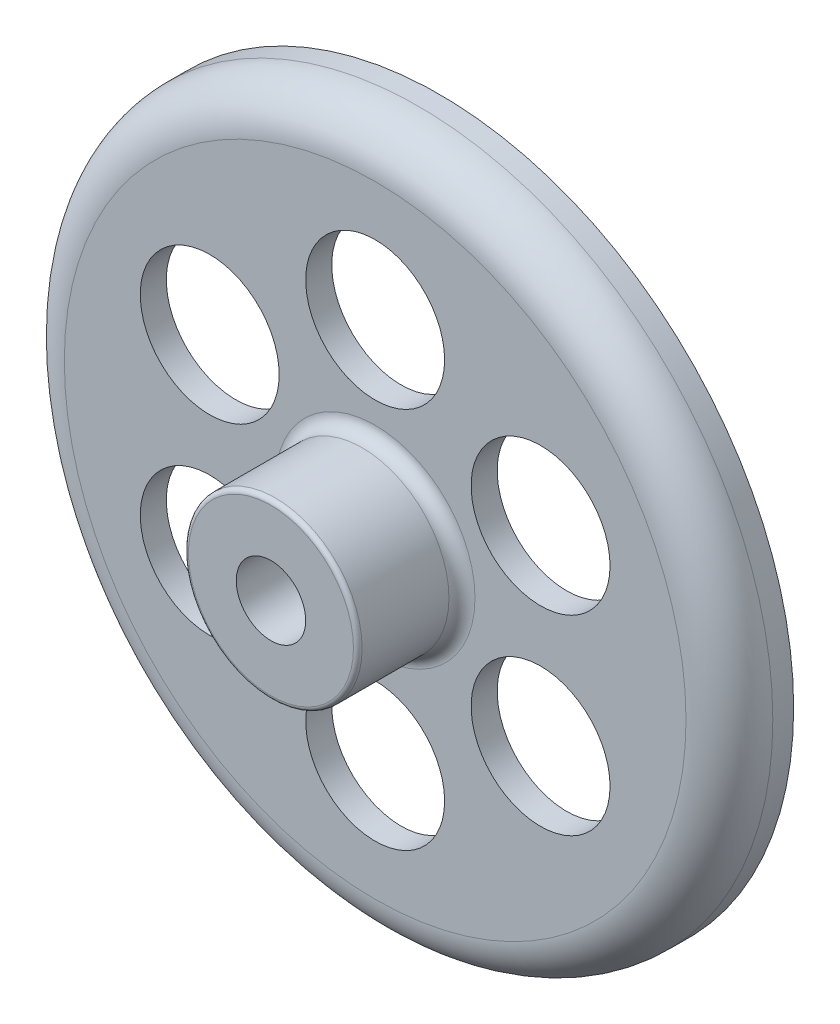
ISO-10303-21;
HEADER;
FILE_DESCRIPTION(('STEP AP214'),'2;1');
FILE_NAME('part.step','',(''),(''),'','','');
FILE_SCHEMA(('AUTOMOTIVE_DESIGN { 1 0 10303 214 1 1 1 1 }'));
ENDSEC;
DATA;
#1=APPLICATION_CONTEXT('core data for automotive mechanical design processes');
#2=APPLICATION_PROTOCOL_DEFINITION('international standard','automotive_design',2000,#1);
#3=PRODUCT_CONTEXT('',#1,'mechanical');
#4=PRODUCT('Part','Part','',(#3));
#5=PRODUCT_RELATED_PRODUCT_CATEGORY('part','',(#4));
#6=PRODUCT_DEFINITION_FORMATION('','',#4);
#7=PRODUCT_DEFINITION_CONTEXT('part definition',#1,'design');
#8=PRODUCT_DEFINITION('design','',#6,#7);
#9=PRODUCT_DEFINITION_SHAPE('','',#8);
#10=(LENGTH_UNIT() NAMED_UNIT(*) SI_UNIT(.MILLI.,.METRE.));
#11=(NAMED_UNIT(*) PLANE_ANGLE_UNIT() SI_UNIT($,.RADIAN.));
#12=(NAMED_UNIT(*) SI_UNIT($,.STERADIAN.) SOLID_ANGLE_UNIT());
#13=UNCERTAINTY_MEASURE_WITH_UNIT(LENGTH_MEASURE(1.E-05),#10,'distance_accuracy_value','');
#14=(GEOMETRIC_REPRESENTATION_CONTEXT(3) GLOBAL_UNCERTAINTY_ASSIGNED_CONTEXT((#13)) GLOBAL_UNIT_ASSIGNED_CONTEXT((#10,
#11,#12)) REPRESENTATION_CONTEXT('',''));
#15=CARTESIAN_POINT('',(0.,0.,0.));
#16=DIRECTION('',(0.,0.,1.));
#17=DIRECTION('',(1.,0.,0.));
#18=AXIS2_PLACEMENT_3D('',#15,#16,#17);
#19=CARTESIAN_POINT('',(0.,0.,0.600000000000001));
#20=DIRECTION('',(0.,0.,1.));
#21=DIRECTION('',(1.,0.,0.));
#22=AXIS2_PLACEMENT_3D('',#19,#20,#21);
#23=CYLINDRICAL_SURFACE('',#22,20.4);
#24=CARTESIAN_POINT('',(0.,0.,0.));
#25=DIRECTION('',(0.,0.,1.));
#26=DIRECTION('',(1.,0.,0.));
#27=AXIS2_PLACEMENT_3D('',#24,#25,#26);
#28=CIRCLE('',#27,20.4);
#29=CARTESIAN_POINT('',(20.4,0.,0.));
#30=VERTEX_POINT('',#29);
#31=EDGE_CURVE('E18',#30,#30,#28,.F.);
#32=ORIENTED_EDGE('',*,*,#31,.F.);
#33=EDGE_LOOP('',(#32));
#34=FACE_BOUND('',#33,.T.);
#35=CARTESIAN_POINT('',(0.,0.,1.20000000000001));
#36=DIRECTION('',(0.,0.,1.));
#37=DIRECTION('',(1.,0.,0.));
#38=AXIS2_PLACEMENT_3D('',#35,#36,#37);
#39=CIRCLE('',#38,20.4);
#40=CARTESIAN_POINT('',(20.4,0.,1.20000000000001));
#41=VERTEX_POINT('',#40);
#42=EDGE_CURVE('E85',#41,#41,#39,.T.);
#43=ORIENTED_EDGE('',*,*,#42,.F.);
#44=EDGE_LOOP('',(#43));
#45=FACE_BOUND('',#44,.T.);
#46=ADVANCED_FACE('F15',(#34,#45),#23,.T.);
#47=CARTESIAN_POINT('',(0.,0.,6.95));
#48=DIRECTION('',(0.,0.,1.));
#49=DIRECTION('',(1.,0.,0.));
#50=AXIS2_PLACEMENT_3D('',#47,#48,#49);
#51=CYLINDRICAL_SURFACE('',#50,5.);
#52=CARTESIAN_POINT('',(0.,0.,4.45));
#53=DIRECTION('',(0.,0.,1.));
#54=DIRECTION('',(1.,0.,0.));
#55=AXIS2_PLACEMENT_3D('',#52,#53,#54);
#56=CIRCLE('',#55,5.);
#57=CARTESIAN_POINT('',(5.,0.,4.45));
#58=VERTEX_POINT('',#57);
#59=EDGE_CURVE('E80',#58,#58,#56,.T.);
#60=ORIENTED_EDGE('',*,*,#59,.T.);
#61=EDGE_LOOP('',(#60));
#62=FACE_BOUND('',#61,.T.);
#63=CARTESIAN_POINT('',(0.,0.,9.45));
#64=DIRECTION('',(0.,0.,1.));
#65=DIRECTION('',(1.,0.,0.));
#66=AXIS2_PLACEMENT_3D('',#63,#64,#65);
#67=CIRCLE('',#66,5.);
#68=CARTESIAN_POINT('',(5.,0.,9.45));
#69=VERTEX_POINT('',#68);
#70=EDGE_CURVE('E74',#69,#69,#67,.T.);
#71=ORIENTED_EDGE('',*,*,#70,.F.);
#72=EDGE_LOOP('',(#71));
#73=FACE_BOUND('',#72,.T.);
#74=ADVANCED_FACE('F209',(#62,#73),#51,.T.);
#75=CARTESIAN_POINT('',(19.65,0.,0.));
#76=DIRECTION('',(0.,0.,-1.));
#77=DIRECTION('',(-1.,0.,0.));
#78=AXIS2_PLACEMENT_3D('',#75,#76,#77);
#79=PLANE('',#78);
#80=CARTESIAN_POINT('',(0.,0.,0.));
#81=DIRECTION('',(0.,0.,1.));
#82=DIRECTION('',(1.,0.,0.));
#83=AXIS2_PLACEMENT_3D('',#80,#81,#82);
#84=CIRCLE('',#83,18.9);
#85=CARTESIAN_POINT('',(18.9,0.,0.));
#86=VERTEX_POINT('',#85);
#87=EDGE_CURVE('E71',#86,#86,#84,.T.);
#88=ORIENTED_EDGE('',*,*,#87,.T.);
#89=EDGE_LOOP('',(#88));
#90=FACE_BOUND('',#89,.T.);
#91=ORIENTED_EDGE('',*,*,#31,.T.);
#92=EDGE_LOOP('',(#91));
#93=FACE_BOUND('',#92,.T.);
#94=ADVANCED_FACE('F212',(#90,#93),#79,.T.);
#95=CARTESIAN_POINT('',(0.,0.,1.20000000000001));
#96=DIRECTION('',(0.,0.,1.));
#97=DIRECTION('',(1.,0.,0.));
#98=AXIS2_PLACEMENT_3D('',#95,#96,#97);
#99=TOROIDAL_SURFACE('',#98,17.9,2.5);
#100=ORIENTED_EDGE('',*,*,#42,.T.);
#101=EDGE_LOOP('',(#100));
#102=FACE_BOUND('',#101,.T.);
#103=CARTESIAN_POINT('',(0.,0.,3.7));
#104=DIRECTION('',(0.,0.,-1.));
#105=DIRECTION('',(1.,0.,0.));
#106=AXIS2_PLACEMENT_3D('',#103,#104,#105);
#107=CIRCLE('',#106,17.9);
#108=CARTESIAN_POINT('',(17.9,0.,3.7));
#109=VERTEX_POINT('',#108);
#110=EDGE_CURVE('E73',#109,#109,#107,.F.);
#111=ORIENTED_EDGE('',*,*,#110,.F.);
#112=EDGE_LOOP('',(#111));
#113=FACE_BOUND('',#112,.T.);
#114=ADVANCED_FACE('F118',(#102,#113),#99,.T.);
#115=CARTESIAN_POINT('',(0.,0.,4.45000000000001));
#116=DIRECTION('',(0.,0.,1.));
#117=DIRECTION('',(1.,0.,0.));
#118=AXIS2_PLACEMENT_3D('',#115,#116,#117);
#119=TOROIDAL_SURFACE('',#118,5.75000000000001,0.750000000000006);
#120=CARTESIAN_POINT('',(0.,0.,3.7));
#121=DIRECTION('',(0.,0.,1.));
#122=DIRECTION('',(1.,0.,0.));
#123=AXIS2_PLACEMENT_3D('',#120,#121,#122);
#124=CIRCLE('',#123,5.75);
#125=CARTESIAN_POINT('',(5.75,0.,3.7));
#126=VERTEX_POINT('',#125);
#127=EDGE_CURVE('E78',#126,#126,#124,.F.);
#128=ORIENTED_EDGE('',*,*,#127,.F.);
#129=EDGE_LOOP('',(#128));
#130=FACE_BOUND('',#129,.T.);
#131=ORIENTED_EDGE('',*,*,#59,.F.);
#132=EDGE_LOOP('',(#131));
#133=FACE_BOUND('',#132,.T.);
#134=ADVANCED_FACE('F114',(#130,#133),#119,.F.);
#135=CARTESIAN_POINT('',(0.,0.,9.45));
#136=DIRECTION('',(0.,0.,1.));
#137=DIRECTION('',(1.,0.,0.));
#138=AXIS2_PLACEMENT_3D('',#135,#136,#137);
#139=TOROIDAL_SURFACE('',#138,4.75,0.25);
#140=ORIENTED_EDGE('',*,*,#70,.T.);
#141=EDGE_LOOP('',(#140));
#142=FACE_BOUND('',#141,.T.);
#143=CARTESIAN_POINT('',(0.,0.,9.7));
#144=DIRECTION('',(0.,0.,-1.));
#145=DIRECTION('',(1.,0.,0.));
#146=AXIS2_PLACEMENT_3D('',#143,#144,#145);
#147=CIRCLE('',#146,4.75);
#148=CARTESIAN_POINT('',(4.75,0.,9.7));
#149=VERTEX_POINT('',#148);
#150=EDGE_CURVE('E97',#149,#149,#147,.F.);
#151=ORIENTED_EDGE('',*,*,#150,.F.);
#152=EDGE_LOOP('',(#151));
#153=FACE_BOUND('',#152,.T.);
#154=ADVANCED_FACE('F103',(#142,#153),#139,.T.);
#155=CARTESIAN_POINT('',(0.,0.,0.474999999999999));
#156=DIRECTION('',(0.,0.,1.));
#157=DIRECTION('',(1.,0.,0.));
#158=AXIS2_PLACEMENT_3D('',#155,#156,#157);
#159=CYLINDRICAL_SURFACE('',#158,18.9);
#160=CARTESIAN_POINT('',(0.,0.,0.949999999999998));
#161=DIRECTION('',(0.,0.,1.));
#162=DIRECTION('',(1.,0.,0.));
#163=AXIS2_PLACEMENT_3D('',#160,#161,#162);
#164=CIRCLE('',#163,18.9);
#165=CARTESIAN_POINT('',(18.9,0.,0.949999999999998));
#166=VERTEX_POINT('',#165);
#167=EDGE_CURVE('E70',#166,#166,#164,.T.);
#168=ORIENTED_EDGE('',*,*,#167,.T.);
#169=EDGE_LOOP('',(#168));
#170=FACE_BOUND('',#169,.T.);
#171=ORIENTED_EDGE('',*,*,#87,.F.);
#172=EDGE_LOOP('',(#171));
#173=FACE_BOUND('',#172,.T.);
#174=ADVANCED_FACE('F113',(#170,#173),#159,.F.);
#175=CARTESIAN_POINT('',(11.825,0.,3.7));
#176=DIRECTION('',(0.,0.,1.));
#177=DIRECTION('',(1.,0.,0.));
#178=AXIS2_PLACEMENT_3D('',#175,#176,#177);
#179=PLANE('',#178);
#180=ORIENTED_EDGE('',*,*,#127,.T.);
#181=EDGE_LOOP('',(#180));
#182=FACE_BOUND('',#181,.T.);
#183=CARTESIAN_POINT('',(0.,11.,3.7));
#184=DIRECTION('',(0.,0.,1.));
#185=DIRECTION('',(1.,0.,0.));
#186=AXIS2_PLACEMENT_3D('',#183,#184,#185);
#187=CIRCLE('',#186,4.);
#188=CARTESIAN_POINT('',(4.,11.,3.7));
#189=VERTEX_POINT('',#188);
#190=EDGE_CURVE('E53',#189,#189,#187,.F.);
#191=ORIENTED_EDGE('',*,*,#190,.T.);
#192=EDGE_LOOP('',(#191));
#193=FACE_BOUND('',#192,.T.);
#194=CARTESIAN_POINT('',(-9.52627944162882,5.5,3.7));
#195=DIRECTION('',(0.,0.,1.));
#196=DIRECTION('',(1.,0.,0.));
#197=AXIS2_PLACEMENT_3D('',#194,#195,#196);
#198=CIRCLE('',#197,4.);
#199=CARTESIAN_POINT('',(-5.52627944162882,5.5,3.7));
#200=VERTEX_POINT('',#199);
#201=EDGE_CURVE('E56',#200,#200,#198,.F.);
#202=ORIENTED_EDGE('',*,*,#201,.T.);
#203=EDGE_LOOP('',(#202));
#204=FACE_BOUND('',#203,.T.);
#205=CARTESIAN_POINT('',(-9.52627944162883,-5.5,3.7));
#206=DIRECTION('',(0.,0.,1.));
#207=DIRECTION('',(1.,0.,0.));
#208=AXIS2_PLACEMENT_3D('',#205,#206,#207);
#209=CIRCLE('',#208,4.);
#210=CARTESIAN_POINT('',(-5.52627944162883,-5.5,3.7));
#211=VERTEX_POINT('',#210);
#212=EDGE_CURVE('E59',#211,#211,#209,.F.);
#213=ORIENTED_EDGE('',*,*,#212,.T.);
#214=EDGE_LOOP('',(#213));
#215=FACE_BOUND('',#214,.T.);
#216=CARTESIAN_POINT('',(0.,-11.,3.7));
#217=DIRECTION('',(0.,0.,1.));
#218=DIRECTION('',(1.,0.,0.));
#219=AXIS2_PLACEMENT_3D('',#216,#217,#218);
#220=CIRCLE('',#219,4.);
#221=CARTESIAN_POINT('',(4.,-11.,3.7));
#222=VERTEX_POINT('',#221);
#223=EDGE_CURVE('E62',#222,#222,#220,.F.);
#224=ORIENTED_EDGE('',*,*,#223,.T.);
#225=EDGE_LOOP('',(#224));
#226=FACE_BOUND('',#225,.T.);
#227=CARTESIAN_POINT('',(9.52627944162882,-5.50000000000001,3.7));
#228=DIRECTION('',(0.,0.,1.));
#229=DIRECTION('',(1.,0.,0.));
#230=AXIS2_PLACEMENT_3D('',#227,#228,#229);
#231=CIRCLE('',#230,4.);
#232=CARTESIAN_POINT('',(13.5262794416288,-5.50000000000001,3.7));
#233=VERTEX_POINT('',#232);
#234=EDGE_CURVE('E65',#233,#233,#231,.F.);
#235=ORIENTED_EDGE('',*,*,#234,.T.);
#236=EDGE_LOOP('',(#235));
#237=FACE_BOUND('',#236,.T.);
#238=CARTESIAN_POINT('',(9.52627944162883,5.49999999999999,3.7));
#239=DIRECTION('',(0.,0.,1.));
#240=DIRECTION('',(1.,0.,0.));
#241=AXIS2_PLACEMENT_3D('',#238,#239,#240);
#242=CIRCLE('',#241,4.);
#243=CARTESIAN_POINT('',(13.5262794416288,5.49999999999999,3.7));
#244=VERTEX_POINT('',#243);
#245=EDGE_CURVE('E68',#244,#244,#242,.F.);
#246=ORIENTED_EDGE('',*,*,#245,.T.);
#247=EDGE_LOOP('',(#246));
#248=FACE_BOUND('',#247,.T.);
#249=ORIENTED_EDGE('',*,*,#110,.T.);
#250=EDGE_LOOP('',(#249));
#251=FACE_BOUND('',#250,.T.);
#252=ADVANCED_FACE('F143',(#182,#193,#204,#215,#226,#237,#248,#251),#179,.T.);
#253=CARTESIAN_POINT('',(3.375,0.,9.7));
#254=DIRECTION('',(0.,0.,1.));
#255=DIRECTION('',(1.,0.,0.));
#256=AXIS2_PLACEMENT_3D('',#253,#254,#255);
#257=PLANE('',#256);
#258=CARTESIAN_POINT('',(0.,0.,9.7));
#259=DIRECTION('',(0.,0.,1.));
#260=DIRECTION('',(1.,0.,0.));
#261=AXIS2_PLACEMENT_3D('',#258,#259,#260);
#262=CIRCLE('',#261,2.);
#263=CARTESIAN_POINT('',(2.,0.,9.7));
#264=VERTEX_POINT('',#263);
#265=EDGE_CURVE('E50',#264,#264,#262,.F.);
#266=ORIENTED_EDGE('',*,*,#265,.T.);
#267=EDGE_LOOP('',(#266));
#268=FACE_BOUND('',#267,.T.);
#269=ORIENTED_EDGE('',*,*,#150,.T.);
#270=EDGE_LOOP('',(#269));
#271=FACE_BOUND('',#270,.T.);
#272=ADVANCED_FACE('F161',(#268,#271),#257,.T.);
#273=CARTESIAN_POINT('',(0.,0.,0.949999999999998));
#274=DIRECTION('',(0.,0.,1.));
#275=DIRECTION('',(1.,0.,0.));
#276=AXIS2_PLACEMENT_3D('',#273,#274,#275);
#277=TOROIDAL_SURFACE('',#276,17.65,1.25);
#278=CARTESIAN_POINT('',(0.,0.,2.2));
#279=DIRECTION('',(0.,0.,1.));
#280=DIRECTION('',(1.,0.,0.));
#281=AXIS2_PLACEMENT_3D('',#278,#279,#280);
#282=CIRCLE('',#281,17.65);
#283=CARTESIAN_POINT('',(17.65,0.,2.2));
#284=VERTEX_POINT('',#283);
#285=EDGE_CURVE('E49',#284,#284,#282,.F.);
#286=ORIENTED_EDGE('',*,*,#285,.F.);
#287=EDGE_LOOP('',(#286));
#288=FACE_BOUND('',#287,.T.);
#289=ORIENTED_EDGE('',*,*,#167,.F.);
#290=EDGE_LOOP('',(#289));
#291=FACE_BOUND('',#290,.T.);
#292=ADVANCED_FACE('F174',(#288,#291),#277,.F.);
#293=CARTESIAN_POINT('',(9.52627944162883,5.49999999999999,-54.8095718664904));
#294=DIRECTION('',(0.,0.,1.));
#295=DIRECTION('',(1.,0.,0.));
#296=AXIS2_PLACEMENT_3D('',#293,#294,#295);
#297=CYLINDRICAL_SURFACE('',#296,4.);
#298=ORIENTED_EDGE('',*,*,#245,.F.);
#299=EDGE_LOOP('',(#298));
#300=FACE_BOUND('',#299,.T.);
#301=CARTESIAN_POINT('',(9.52627944162883,5.49999999999999,2.20000000000001));
#302=DIRECTION('',(0.,0.,1.));
#303=DIRECTION('',(1.,0.,0.));
#304=AXIS2_PLACEMENT_3D('',#301,#302,#303);
#305=CIRCLE('',#304,4.);
#306=CARTESIAN_POINT('',(13.5262794416288,5.49999999999999,2.20000000000001));
#307=VERTEX_POINT('',#306);
#308=EDGE_CURVE('E46',#307,#307,#305,.T.);
#309=ORIENTED_EDGE('',*,*,#308,.F.);
#310=EDGE_LOOP('',(#309));
#311=FACE_BOUND('',#310,.T.);
#312=ADVANCED_FACE('F180',(#300,#311),#297,.F.);
#313=CARTESIAN_POINT('',(9.52627944162882,-5.50000000000001,-54.8095718664904));
#314=DIRECTION('',(0.,0.,1.));
#315=DIRECTION('',(1.,0.,0.));
#316=AXIS2_PLACEMENT_3D('',#313,#314,#315);
#317=CYLINDRICAL_SURFACE('',#316,4.);
#318=ORIENTED_EDGE('',*,*,#234,.F.);
#319=EDGE_LOOP('',(#318));
#320=FACE_BOUND('',#319,.T.);
#321=CARTESIAN_POINT('',(9.52627944162882,-5.50000000000001,2.20000000000001));
#322=DIRECTION('',(0.,0.,1.));
#323=DIRECTION('',(1.,0.,0.));
#324=AXIS2_PLACEMENT_3D('',#321,#322,#323);
#325=CIRCLE('',#324,4.);
#326=CARTESIAN_POINT('',(13.5262794416288,-5.50000000000001,2.20000000000001));
#327=VERTEX_POINT('',#326);
#328=EDGE_CURVE('E43',#327,#327,#325,.T.);
#329=ORIENTED_EDGE('',*,*,#328,.F.);
#330=EDGE_LOOP('',(#329));
#331=FACE_BOUND('',#330,.T.);
#332=ADVANCED_FACE('F244',(#320,#331),#317,.F.);
#333=CARTESIAN_POINT('',(0.,-11.,-54.8095718664904));
#334=DIRECTION('',(0.,0.,1.));
#335=DIRECTION('',(1.,0.,0.));
#336=AXIS2_PLACEMENT_3D('',#333,#334,#335);
#337=CYLINDRICAL_SURFACE('',#336,4.);
#338=ORIENTED_EDGE('',*,*,#223,.F.);
#339=EDGE_LOOP('',(#338));
#340=FACE_BOUND('',#339,.T.);
#341=CARTESIAN_POINT('',(0.,-11.,2.20000000000001));
#342=DIRECTION('',(0.,0.,1.));
#343=DIRECTION('',(1.,0.,0.));
#344=AXIS2_PLACEMENT_3D('',#341,#342,#343);
#345=CIRCLE('',#344,4.);
#346=CARTESIAN_POINT('',(4.,-11.,2.20000000000001));
#347=VERTEX_POINT('',#346);
#348=EDGE_CURVE('E40',#347,#347,#345,.T.);
#349=ORIENTED_EDGE('',*,*,#348,.F.);
#350=EDGE_LOOP('',(#349));
#351=FACE_BOUND('',#350,.T.);
#352=ADVANCED_FACE('F241',(#340,#351),#337,.F.);
#353=CARTESIAN_POINT('',(-9.52627944162883,-5.5,-54.8095718664904));
#354=DIRECTION('',(0.,0.,1.));
#355=DIRECTION('',(1.,0.,0.));
#356=AXIS2_PLACEMENT_3D('',#353,#354,#355);
#357=CYLINDRICAL_SURFACE('',#356,4.);
#358=ORIENTED_EDGE('',*,*,#212,.F.);
#359=EDGE_LOOP('',(#358));
#360=FACE_BOUND('',#359,.T.);
#361=CARTESIAN_POINT('',(-9.52627944162883,-5.5,2.20000000000001));
#362=DIRECTION('',(0.,0.,1.));
#363=DIRECTION('',(1.,0.,0.));
#364=AXIS2_PLACEMENT_3D('',#361,#362,#363);
#365=CIRCLE('',#364,4.);
#366=CARTESIAN_POINT('',(-5.52627944162883,-5.5,2.20000000000001));
#367=VERTEX_POINT('',#366);
#368=EDGE_CURVE('E37',#367,#367,#365,.T.);
#369=ORIENTED_EDGE('',*,*,#368,.F.);
#370=EDGE_LOOP('',(#369));
#371=FACE_BOUND('',#370,.T.);
#372=ADVANCED_FACE('F237',(#360,#371),#357,.F.);
#373=CARTESIAN_POINT('',(-9.52627944162882,5.5,-54.8095718664904));
#374=DIRECTION('',(0.,0.,1.));
#375=DIRECTION('',(1.,0.,0.));
#376=AXIS2_PLACEMENT_3D('',#373,#374,#375);
#377=CYLINDRICAL_SURFACE('',#376,4.);
#378=ORIENTED_EDGE('',*,*,#201,.F.);
#379=EDGE_LOOP('',(#378));
#380=FACE_BOUND('',#379,.T.);
#381=CARTESIAN_POINT('',(-9.52627944162882,5.5,2.20000000000001));
#382=DIRECTION('',(0.,0.,1.));
#383=DIRECTION('',(1.,0.,0.));
#384=AXIS2_PLACEMENT_3D('',#381,#382,#383);
#385=CIRCLE('',#384,4.);
#386=CARTESIAN_POINT('',(-5.52627944162882,5.5,2.20000000000001));
#387=VERTEX_POINT('',#386);
#388=EDGE_CURVE('E27',#387,#387,#385,.T.);
#389=ORIENTED_EDGE('',*,*,#388,.F.);
#390=EDGE_LOOP('',(#389));
#391=FACE_BOUND('',#390,.T.);
#392=ADVANCED_FACE('F233',(#380,#391),#377,.F.);
#393=CARTESIAN_POINT('',(0.,11.,-54.8095718664904));
#394=DIRECTION('',(0.,0.,1.));
#395=DIRECTION('',(1.,0.,0.));
#396=AXIS2_PLACEMENT_3D('',#393,#394,#395);
#397=CYLINDRICAL_SURFACE('',#396,4.);
#398=ORIENTED_EDGE('',*,*,#190,.F.);
#399=EDGE_LOOP('',(#398));
#400=FACE_BOUND('',#399,.T.);
#401=CARTESIAN_POINT('',(0.,11.,2.20000000000001));
#402=DIRECTION('',(0.,0.,1.));
#403=DIRECTION('',(1.,0.,0.));
#404=AXIS2_PLACEMENT_3D('',#401,#402,#403);
#405=CIRCLE('',#404,4.);
#406=CARTESIAN_POINT('',(4.,11.,2.20000000000001));
#407=VERTEX_POINT('',#406);
#408=EDGE_CURVE('E22',#407,#407,#405,.T.);
#409=ORIENTED_EDGE('',*,*,#408,.F.);
#410=EDGE_LOOP('',(#409));
#411=FACE_BOUND('',#410,.T.);
#412=ADVANCED_FACE('F225',(#400,#411),#397,.F.);
#413=CARTESIAN_POINT('',(0.,0.,5.95));
#414=DIRECTION('',(0.,0.,1.));
#415=DIRECTION('',(1.,0.,0.));
#416=AXIS2_PLACEMENT_3D('',#413,#414,#415);
#417=CYLINDRICAL_SURFACE('',#416,2.);
#418=ORIENTED_EDGE('',*,*,#265,.F.);
#419=EDGE_LOOP('',(#418));
#420=FACE_BOUND('',#419,.T.);
#421=CARTESIAN_POINT('',(0.,0.,2.2));
#422=DIRECTION('',(0.,0.,1.));
#423=DIRECTION('',(1.,0.,0.));
#424=AXIS2_PLACEMENT_3D('',#421,#422,#423);
#425=CIRCLE('',#424,2.);
#426=CARTESIAN_POINT('',(2.,0.,2.2));
#427=VERTEX_POINT('',#426);
#428=EDGE_CURVE('E10',#427,#427,#425,.T.);
#429=ORIENTED_EDGE('',*,*,#428,.F.);
#430=EDGE_LOOP('',(#429));
#431=FACE_BOUND('',#430,.T.);
#432=ADVANCED_FACE('F221',(#420,#431),#417,.F.);
#433=CARTESIAN_POINT('',(9.825,0.,2.2));
#434=DIRECTION('',(0.,0.,-1.));
#435=DIRECTION('',(-1.,0.,0.));
#436=AXIS2_PLACEMENT_3D('',#433,#434,#435);
#437=PLANE('',#436);
#438=ORIENTED_EDGE('',*,*,#428,.T.);
#439=EDGE_LOOP('',(#438));
#440=FACE_BOUND('',#439,.T.);
#441=ORIENTED_EDGE('',*,*,#408,.T.);
#442=EDGE_LOOP('',(#441));
#443=FACE_BOUND('',#442,.T.);
#444=ORIENTED_EDGE('',*,*,#388,.T.);
#445=EDGE_LOOP('',(#444));
#446=FACE_BOUND('',#445,.T.);
#447=ORIENTED_EDGE('',*,*,#368,.T.);
#448=EDGE_LOOP('',(#447));
#449=FACE_BOUND('',#448,.T.);
#450=ORIENTED_EDGE('',*,*,#348,.T.);
#451=EDGE_LOOP('',(#450));
#452=FACE_BOUND('',#451,.T.);
#453=ORIENTED_EDGE('',*,*,#328,.T.);
#454=EDGE_LOOP('',(#453));
#455=FACE_BOUND('',#454,.T.);
#456=ORIENTED_EDGE('',*,*,#308,.T.);
#457=EDGE_LOOP('',(#456));
#458=FACE_BOUND('',#457,.T.);
#459=ORIENTED_EDGE('',*,*,#285,.T.);
#460=EDGE_LOOP('',(#459));
#461=FACE_BOUND('',#460,.T.);
#462=ADVANCED_FACE('F219',(#440,#443,#446,#449,#452,#455,#458,#461),#437,.T.);
#463=CLOSED_SHELL('',(#46,#74,#94,#114,#134,#154,#174,#252,#272,#292,#312,#332,#352,#372,#392,
#412,#432,#462));
#464=MANIFOLD_SOLID_BREP('B1',#463);
#465=ADVANCED_BREP_SHAPE_REPRESENTATION('',(#18,#464),#14);
#466=SHAPE_DEFINITION_REPRESENTATION(#9,#465);
ENDSEC;
END-ISO-10303-21;
